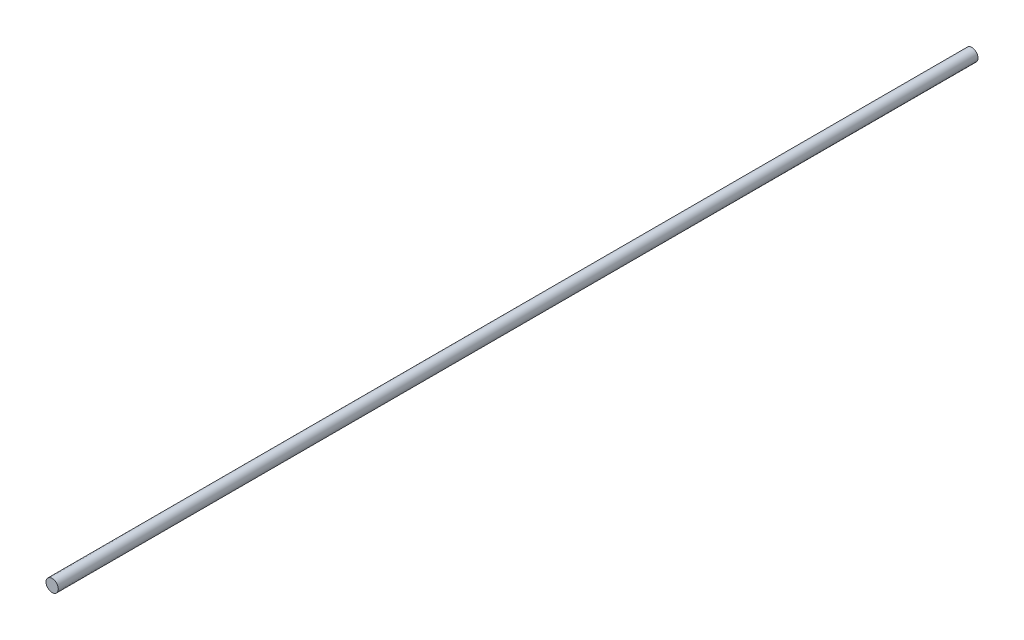
ISO-10303-21;
HEADER;
FILE_DESCRIPTION(('STEP AP214'),'2;1');
FILE_NAME('part.step','',(''),(''),'','','');
FILE_SCHEMA(('AUTOMOTIVE_DESIGN { 1 0 10303 214 1 1 1 1 }'));
ENDSEC;
DATA;
#1=APPLICATION_CONTEXT('core data for automotive mechanical design processes');
#2=APPLICATION_PROTOCOL_DEFINITION('international standard','automotive_design',2000,#1);
#3=PRODUCT_CONTEXT('',#1,'mechanical');
#4=PRODUCT('Part','Part','',(#3));
#5=PRODUCT_RELATED_PRODUCT_CATEGORY('part','',(#4));
#6=PRODUCT_DEFINITION_FORMATION('','',#4);
#7=PRODUCT_DEFINITION_CONTEXT('part definition',#1,'design');
#8=PRODUCT_DEFINITION('design','',#6,#7);
#9=PRODUCT_DEFINITION_SHAPE('','',#8);
#10=(LENGTH_UNIT() NAMED_UNIT(*) SI_UNIT(.MILLI.,.METRE.));
#11=(NAMED_UNIT(*) PLANE_ANGLE_UNIT() SI_UNIT($,.RADIAN.));
#12=(NAMED_UNIT(*) SI_UNIT($,.STERADIAN.) SOLID_ANGLE_UNIT());
#13=UNCERTAINTY_MEASURE_WITH_UNIT(LENGTH_MEASURE(1.E-05),#10,'distance_accuracy_value','');
#14=(GEOMETRIC_REPRESENTATION_CONTEXT(3) GLOBAL_UNCERTAINTY_ASSIGNED_CONTEXT((#13)) GLOBAL_UNIT_ASSIGNED_CONTEXT((#10,
#11,#12)) REPRESENTATION_CONTEXT('',''));
#15=CARTESIAN_POINT('',(0.,0.,0.));
#16=DIRECTION('',(0.,0.,1.));
#17=DIRECTION('',(1.,0.,0.));
#18=AXIS2_PLACEMENT_3D('',#15,#16,#17);
#19=CARTESIAN_POINT('',(0.,0.,475.));
#20=DIRECTION('',(0.,0.,-1.));
#21=DIRECTION('',(-1.,0.,0.));
#22=AXIS2_PLACEMENT_3D('',#19,#20,#21);
#23=CYLINDRICAL_SURFACE('',#22,3.175);
#24=CARTESIAN_POINT('',(0.,0.,475.));
#25=DIRECTION('',(0.,0.,1.));
#26=DIRECTION('',(1.,0.,0.));
#27=AXIS2_PLACEMENT_3D('',#24,#25,#26);
#28=CIRCLE('',#27,3.175);
#29=CARTESIAN_POINT('',(3.175,0.,475.));
#30=VERTEX_POINT('',#29);
#31=EDGE_CURVE('E10',#30,#30,#28,.T.);
#32=ORIENTED_EDGE('',*,*,#31,.F.);
#33=EDGE_LOOP('',(#32));
#34=FACE_BOUND('',#33,.T.);
#35=CARTESIAN_POINT('',(0.,0.,0.));
#36=DIRECTION('',(0.,0.,1.));
#37=DIRECTION('',(1.,0.,0.));
#38=AXIS2_PLACEMENT_3D('',#35,#36,#37);
#39=CIRCLE('',#38,3.175);
#40=CARTESIAN_POINT('',(3.175,0.,0.));
#41=VERTEX_POINT('',#40);
#42=EDGE_CURVE('E32',#41,#41,#39,.T.);
#43=ORIENTED_EDGE('',*,*,#42,.T.);
#44=EDGE_LOOP('',(#43));
#45=FACE_BOUND('',#44,.T.);
#46=ADVANCED_FACE('F29',(#34,#45),#23,.T.);
#47=CARTESIAN_POINT('',(0.,0.,475.));
#48=DIRECTION('',(0.,0.,1.));
#49=DIRECTION('',(1.,0.,0.));
#50=AXIS2_PLACEMENT_3D('',#47,#48,#49);
#51=PLANE('',#50);
#52=ORIENTED_EDGE('',*,*,#31,.T.);
#53=EDGE_LOOP('',(#52));
#54=FACE_BOUND('',#53,.T.);
#55=ADVANCED_FACE('F44',(#54),#51,.T.);
#56=CARTESIAN_POINT('',(0.,0.,0.));
#57=DIRECTION('',(0.,0.,1.));
#58=DIRECTION('',(1.,0.,0.));
#59=AXIS2_PLACEMENT_3D('',#56,#57,#58);
#60=PLANE('',#59);
#61=ORIENTED_EDGE('',*,*,#42,.F.);
#62=EDGE_LOOP('',(#61));
#63=FACE_BOUND('',#62,.T.);
#64=ADVANCED_FACE('F42',(#63),#60,.F.);
#65=CLOSED_SHELL('',(#46,#55,#64));
#66=MANIFOLD_SOLID_BREP('B2',#65);
#67=ADVANCED_BREP_SHAPE_REPRESENTATION('',(#18,#66),#14);
#68=SHAPE_DEFINITION_REPRESENTATION(#9,#67);
ENDSEC;
END-ISO-10303-21;
